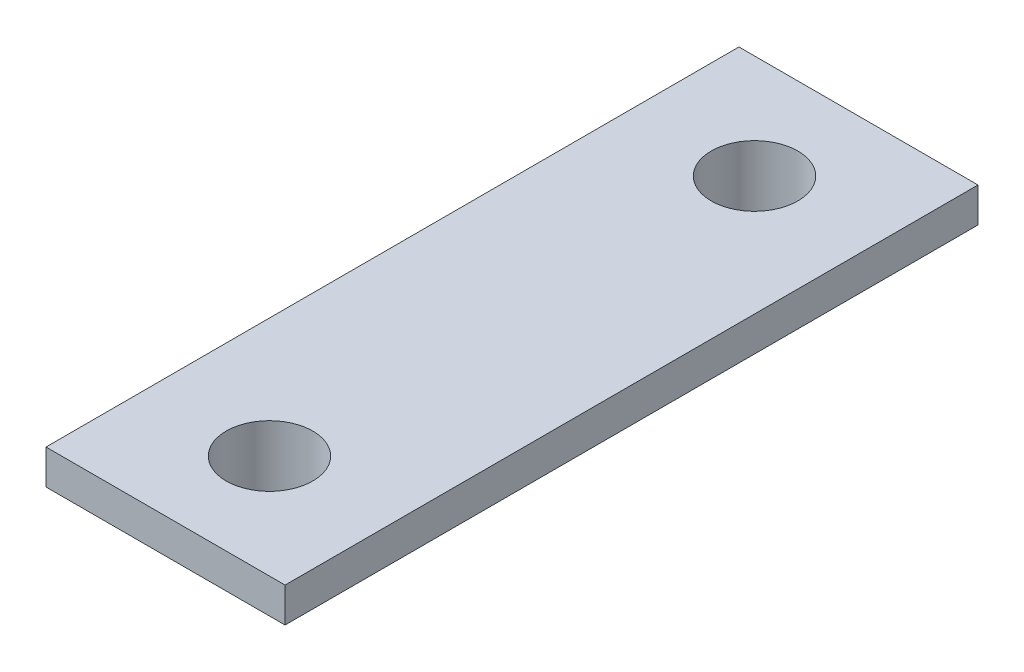
ISO-10303-21;
HEADER;
FILE_DESCRIPTION(('STEP AP214'),'2;1');
FILE_NAME('part.step','',(''),(''),'','','');
FILE_SCHEMA(('AUTOMOTIVE_DESIGN { 1 0 10303 214 1 1 1 1 }'));
ENDSEC;
DATA;
#1=APPLICATION_CONTEXT('core data for automotive mechanical design processes');
#2=APPLICATION_PROTOCOL_DEFINITION('international standard','automotive_design',2000,#1);
#3=PRODUCT_CONTEXT('',#1,'mechanical');
#4=PRODUCT('Part','Part','',(#3));
#5=PRODUCT_RELATED_PRODUCT_CATEGORY('part','',(#4));
#6=PRODUCT_DEFINITION_FORMATION('','',#4);
#7=PRODUCT_DEFINITION_CONTEXT('part definition',#1,'design');
#8=PRODUCT_DEFINITION('design','',#6,#7);
#9=PRODUCT_DEFINITION_SHAPE('','',#8);
#10=(LENGTH_UNIT() NAMED_UNIT(*) SI_UNIT(.MILLI.,.METRE.));
#11=(NAMED_UNIT(*) PLANE_ANGLE_UNIT() SI_UNIT($,.RADIAN.));
#12=(NAMED_UNIT(*) SI_UNIT($,.STERADIAN.) SOLID_ANGLE_UNIT());
#13=UNCERTAINTY_MEASURE_WITH_UNIT(LENGTH_MEASURE(1.E-05),#10,'distance_accuracy_value','');
#14=(GEOMETRIC_REPRESENTATION_CONTEXT(3) GLOBAL_UNCERTAINTY_ASSIGNED_CONTEXT((#13)) GLOBAL_UNIT_ASSIGNED_CONTEXT((#10,
#11,#12)) REPRESENTATION_CONTEXT('',''));
#15=CARTESIAN_POINT('',(0.,0.,0.));
#16=DIRECTION('',(0.,0.,1.));
#17=DIRECTION('',(1.,0.,0.));
#18=AXIS2_PLACEMENT_3D('',#15,#16,#17);
#19=CARTESIAN_POINT('',(3.45,1.,-10.));
#20=DIRECTION('',(-1.,0.,0.));
#21=DIRECTION('',(0.,0.,1.));
#22=AXIS2_PLACEMENT_3D('',#19,#20,#21);
#23=PLANE('',#22);
#24=DIRECTION('',(0.,0.,-1.));
#25=VECTOR('',#24,1.);
#26=CARTESIAN_POINT('',(3.45,0.,-10.));
#27=LINE('',#26,#25);
#28=CARTESIAN_POINT('',(3.45,0.,10.));
#29=VERTEX_POINT('',#28);
#30=CARTESIAN_POINT('',(3.45,0.,-10.));
#31=VERTEX_POINT('',#30);
#32=EDGE_CURVE('E100',#29,#31,#27,.T.);
#33=ORIENTED_EDGE('',*,*,#32,.T.);
#34=DIRECTION('',(0.,-1.,0.));
#35=VECTOR('',#34,1.);
#36=CARTESIAN_POINT('',(3.45,1.,-10.));
#37=LINE('',#36,#35);
#38=CARTESIAN_POINT('',(3.45,1.,-10.));
#39=VERTEX_POINT('',#38);
#40=EDGE_CURVE('E42',#39,#31,#37,.T.);
#41=ORIENTED_EDGE('',*,*,#40,.F.);
#42=DIRECTION('',(0.,0.,-1.));
#43=VECTOR('',#42,1.);
#44=CARTESIAN_POINT('',(3.45,1.,-10.));
#45=LINE('',#44,#43);
#46=CARTESIAN_POINT('',(3.45,1.,10.));
#47=VERTEX_POINT('',#46);
#48=EDGE_CURVE('E86',#47,#39,#45,.T.);
#49=ORIENTED_EDGE('',*,*,#48,.F.);
#50=DIRECTION('',(0.,-1.,0.));
#51=VECTOR('',#50,1.);
#52=CARTESIAN_POINT('',(3.45,1.,10.));
#53=LINE('',#52,#51);
#54=EDGE_CURVE('E96',#47,#29,#53,.T.);
#55=ORIENTED_EDGE('',*,*,#54,.T.);
#56=EDGE_LOOP('',(#33,#41,#49,#55));
#57=FACE_BOUND('',#56,.T.);
#58=ADVANCED_FACE('F34',(#57),#23,.F.);
#59=CARTESIAN_POINT('',(-3.45,1.,-10.));
#60=DIRECTION('',(0.,0.,1.));
#61=DIRECTION('',(1.,0.,0.));
#62=AXIS2_PLACEMENT_3D('',#59,#60,#61);
#63=PLANE('',#62);
#64=DIRECTION('',(-1.,0.,0.));
#65=VECTOR('',#64,1.);
#66=CARTESIAN_POINT('',(-3.45,0.,-10.));
#67=LINE('',#66,#65);
#68=CARTESIAN_POINT('',(-3.45,0.,-10.));
#69=VERTEX_POINT('',#68);
#70=EDGE_CURVE('E91',#31,#69,#67,.T.);
#71=ORIENTED_EDGE('',*,*,#70,.T.);
#72=DIRECTION('',(0.,-1.,0.));
#73=VECTOR('',#72,1.);
#74=CARTESIAN_POINT('',(-3.45,1.,-10.));
#75=LINE('',#74,#73);
#76=CARTESIAN_POINT('',(-3.45,1.,-10.));
#77=VERTEX_POINT('',#76);
#78=EDGE_CURVE('E89',#77,#69,#75,.T.);
#79=ORIENTED_EDGE('',*,*,#78,.F.);
#80=DIRECTION('',(-1.,0.,0.));
#81=VECTOR('',#80,1.);
#82=CARTESIAN_POINT('',(-3.45,1.,-10.));
#83=LINE('',#82,#81);
#84=EDGE_CURVE('E81',#39,#77,#83,.T.);
#85=ORIENTED_EDGE('',*,*,#84,.F.);
#86=ORIENTED_EDGE('',*,*,#40,.T.);
#87=EDGE_LOOP('',(#71,#79,#85,#86));
#88=FACE_BOUND('',#87,.T.);
#89=ADVANCED_FACE('F90',(#88),#63,.F.);
#90=CARTESIAN_POINT('',(-3.45,1.,-10.));
#91=DIRECTION('',(1.,0.,0.));
#92=DIRECTION('',(0.,0.,-1.));
#93=AXIS2_PLACEMENT_3D('',#90,#91,#92);
#94=PLANE('',#93);
#95=DIRECTION('',(0.,0.,1.));
#96=VECTOR('',#95,1.);
#97=CARTESIAN_POINT('',(-3.45,0.,-10.));
#98=LINE('',#97,#96);
#99=CARTESIAN_POINT('',(-3.45,0.,10.));
#100=VERTEX_POINT('',#99);
#101=EDGE_CURVE('E67',#69,#100,#98,.T.);
#102=ORIENTED_EDGE('',*,*,#101,.T.);
#103=DIRECTION('',(0.,-1.,0.));
#104=VECTOR('',#103,1.);
#105=CARTESIAN_POINT('',(-3.45,1.,10.));
#106=LINE('',#105,#104);
#107=CARTESIAN_POINT('',(-3.45,1.,10.));
#108=VERTEX_POINT('',#107);
#109=EDGE_CURVE('E92',#108,#100,#106,.T.);
#110=ORIENTED_EDGE('',*,*,#109,.F.);
#111=DIRECTION('',(0.,0.,1.));
#112=VECTOR('',#111,1.);
#113=CARTESIAN_POINT('',(-3.45,1.,-10.));
#114=LINE('',#113,#112);
#115=EDGE_CURVE('E84',#77,#108,#114,.T.);
#116=ORIENTED_EDGE('',*,*,#115,.F.);
#117=ORIENTED_EDGE('',*,*,#78,.T.);
#118=EDGE_LOOP('',(#102,#110,#116,#117));
#119=FACE_BOUND('',#118,.T.);
#120=ADVANCED_FACE('F94',(#119),#94,.F.);
#121=CARTESIAN_POINT('',(-3.45,1.,10.));
#122=DIRECTION('',(0.,0.,-1.));
#123=DIRECTION('',(-1.,0.,0.));
#124=AXIS2_PLACEMENT_3D('',#121,#122,#123);
#125=PLANE('',#124);
#126=DIRECTION('',(1.,0.,0.));
#127=VECTOR('',#126,1.);
#128=CARTESIAN_POINT('',(-3.45,0.,10.));
#129=LINE('',#128,#127);
#130=EDGE_CURVE('E73',#100,#29,#129,.T.);
#131=ORIENTED_EDGE('',*,*,#130,.T.);
#132=ORIENTED_EDGE('',*,*,#54,.F.);
#133=DIRECTION('',(1.,0.,0.));
#134=VECTOR('',#133,1.);
#135=CARTESIAN_POINT('',(-3.45,1.,10.));
#136=LINE('',#135,#134);
#137=EDGE_CURVE('E50',#108,#47,#136,.T.);
#138=ORIENTED_EDGE('',*,*,#137,.F.);
#139=ORIENTED_EDGE('',*,*,#109,.T.);
#140=EDGE_LOOP('',(#131,#132,#138,#139));
#141=FACE_BOUND('',#140,.T.);
#142=ADVANCED_FACE('F123',(#141),#125,.F.);
#143=CARTESIAN_POINT('',(0.,1.,0.));
#144=DIRECTION('',(0.,1.,0.));
#145=DIRECTION('',(0.,0.,1.));
#146=AXIS2_PLACEMENT_3D('',#143,#144,#145);
#147=PLANE('',#146);
#148=CARTESIAN_POINT('',(0.,1.,7.));
#149=DIRECTION('',(0.,1.,0.));
#150=DIRECTION('',(0.,0.,1.));
#151=AXIS2_PLACEMENT_3D('',#148,#149,#150);
#152=CIRCLE('',#151,1.25);
#153=CARTESIAN_POINT('',(0.,1.,8.25));
#154=VERTEX_POINT('',#153);
#155=EDGE_CURVE('E215',#154,#154,#152,.T.);
#156=ORIENTED_EDGE('',*,*,#155,.F.);
#157=EDGE_LOOP('',(#156));
#158=FACE_BOUND('',#157,.T.);
#159=CARTESIAN_POINT('',(0.,1.,-7.));
#160=DIRECTION('',(0.,1.,0.));
#161=DIRECTION('',(0.,0.,1.));
#162=AXIS2_PLACEMENT_3D('',#159,#160,#161);
#163=CIRCLE('',#162,1.25);
#164=CARTESIAN_POINT('',(0.,1.,-5.75));
#165=VERTEX_POINT('',#164);
#166=EDGE_CURVE('E209',#165,#165,#163,.T.);
#167=ORIENTED_EDGE('',*,*,#166,.F.);
#168=EDGE_LOOP('',(#167));
#169=FACE_BOUND('',#168,.T.);
#170=ORIENTED_EDGE('',*,*,#48,.T.);
#171=ORIENTED_EDGE('',*,*,#84,.T.);
#172=ORIENTED_EDGE('',*,*,#115,.T.);
#173=ORIENTED_EDGE('',*,*,#137,.T.);
#174=EDGE_LOOP('',(#170,#171,#172,#173));
#175=FACE_BOUND('',#174,.T.);
#176=ADVANCED_FACE('F82',(#158,#169,#175),#147,.T.);
#177=CARTESIAN_POINT('',(0.,0.,0.));
#178=DIRECTION('',(0.,1.,0.));
#179=DIRECTION('',(0.,0.,1.));
#180=AXIS2_PLACEMENT_3D('',#177,#178,#179);
#181=PLANE('',#180);
#182=CARTESIAN_POINT('',(0.,0.,7.));
#183=DIRECTION('',(0.,1.,0.));
#184=DIRECTION('',(0.,0.,1.));
#185=AXIS2_PLACEMENT_3D('',#182,#183,#184);
#186=CIRCLE('',#185,1.9);
#187=CARTESIAN_POINT('',(0.,0.,8.9));
#188=VERTEX_POINT('',#187);
#189=EDGE_CURVE('E204',#188,#188,#186,.T.);
#190=ORIENTED_EDGE('',*,*,#189,.T.);
#191=EDGE_LOOP('',(#190));
#192=FACE_BOUND('',#191,.T.);
#193=CARTESIAN_POINT('',(0.,0.,-7.));
#194=DIRECTION('',(0.,1.,0.));
#195=DIRECTION('',(0.,0.,1.));
#196=AXIS2_PLACEMENT_3D('',#193,#194,#195);
#197=CIRCLE('',#196,1.9);
#198=CARTESIAN_POINT('',(0.,0.,-5.1));
#199=VERTEX_POINT('',#198);
#200=EDGE_CURVE('E11',#199,#199,#197,.F.);
#201=ORIENTED_EDGE('',*,*,#200,.F.);
#202=EDGE_LOOP('',(#201));
#203=FACE_BOUND('',#202,.T.);
#204=ORIENTED_EDGE('',*,*,#32,.F.);
#205=ORIENTED_EDGE('',*,*,#130,.F.);
#206=ORIENTED_EDGE('',*,*,#101,.F.);
#207=ORIENTED_EDGE('',*,*,#70,.F.);
#208=EDGE_LOOP('',(#204,#205,#206,#207));
#209=FACE_BOUND('',#208,.T.);
#210=ADVANCED_FACE('F111',(#192,#203,#209),#181,.F.);
#211=CARTESIAN_POINT('',(0.,-0.8,-7.));
#212=DIRECTION('',(0.,1.,0.));
#213=DIRECTION('',(0.,0.,1.));
#214=AXIS2_PLACEMENT_3D('',#211,#212,#213);
#215=CYLINDRICAL_SURFACE('',#214,1.9);
#216=CARTESIAN_POINT('',(0.,-0.8,-7.));
#217=DIRECTION('',(0.,-1.,0.));
#218=DIRECTION('',(0.,0.,-1.));
#219=AXIS2_PLACEMENT_3D('',#216,#217,#218);
#220=CIRCLE('',#219,1.9);
#221=CARTESIAN_POINT('',(0.,-0.8,-8.9));
#222=VERTEX_POINT('',#221);
#223=EDGE_CURVE('E103',#222,#222,#220,.T.);
#224=ORIENTED_EDGE('',*,*,#223,.F.);
#225=EDGE_LOOP('',(#224));
#226=FACE_BOUND('',#225,.T.);
#227=ORIENTED_EDGE('',*,*,#200,.T.);
#228=EDGE_LOOP('',(#227));
#229=FACE_BOUND('',#228,.T.);
#230=ADVANCED_FACE('F113',(#226,#229),#215,.T.);
#231=CARTESIAN_POINT('',(0.,-0.8,-7.));
#232=DIRECTION('',(0.,-1.,0.));
#233=DIRECTION('',(0.,0.,-1.));
#234=AXIS2_PLACEMENT_3D('',#231,#232,#233);
#235=PLANE('',#234);
#236=CARTESIAN_POINT('',(0.,-0.8,-7.));
#237=DIRECTION('',(0.,1.,0.));
#238=DIRECTION('',(0.,0.,1.));
#239=AXIS2_PLACEMENT_3D('',#236,#237,#238);
#240=CIRCLE('',#239,1.25);
#241=CARTESIAN_POINT('',(0.,-0.8,-5.75));
#242=VERTEX_POINT('',#241);
#243=EDGE_CURVE('E198',#242,#242,#240,.T.);
#244=ORIENTED_EDGE('',*,*,#243,.T.);
#245=EDGE_LOOP('',(#244));
#246=FACE_BOUND('',#245,.T.);
#247=ORIENTED_EDGE('',*,*,#223,.T.);
#248=EDGE_LOOP('',(#247));
#249=FACE_BOUND('',#248,.T.);
#250=ADVANCED_FACE('F120',(#246,#249),#235,.T.);
#251=CARTESIAN_POINT('',(0.,-0.8,7.));
#252=DIRECTION('',(0.,1.,0.));
#253=DIRECTION('',(0.,0.,1.));
#254=AXIS2_PLACEMENT_3D('',#251,#252,#253);
#255=CYLINDRICAL_SURFACE('',#254,1.9);
#256=CARTESIAN_POINT('',(0.,-0.8,7.));
#257=DIRECTION('',(0.,1.,0.));
#258=DIRECTION('',(0.,0.,1.));
#259=AXIS2_PLACEMENT_3D('',#256,#257,#258);
#260=CIRCLE('',#259,1.9);
#261=CARTESIAN_POINT('',(0.,-0.8,8.9));
#262=VERTEX_POINT('',#261);
#263=EDGE_CURVE('E201',#262,#262,#260,.T.);
#264=ORIENTED_EDGE('',*,*,#263,.T.);
#265=EDGE_LOOP('',(#264));
#266=FACE_BOUND('',#265,.T.);
#267=ORIENTED_EDGE('',*,*,#189,.F.);
#268=EDGE_LOOP('',(#267));
#269=FACE_BOUND('',#268,.T.);
#270=ADVANCED_FACE('F164',(#266,#269),#255,.T.);
#271=CARTESIAN_POINT('',(0.,-0.8,7.));
#272=DIRECTION('',(0.,-1.,0.));
#273=DIRECTION('',(0.,0.,1.));
#274=AXIS2_PLACEMENT_3D('',#271,#272,#273);
#275=PLANE('',#274);
#276=CARTESIAN_POINT('',(0.,-0.8,7.));
#277=DIRECTION('',(0.,1.,0.));
#278=DIRECTION('',(0.,0.,1.));
#279=AXIS2_PLACEMENT_3D('',#276,#277,#278);
#280=CIRCLE('',#279,1.25);
#281=CARTESIAN_POINT('',(0.,-0.8,8.25));
#282=VERTEX_POINT('',#281);
#283=EDGE_CURVE('E212',#282,#282,#280,.T.);
#284=ORIENTED_EDGE('',*,*,#283,.T.);
#285=EDGE_LOOP('',(#284));
#286=FACE_BOUND('',#285,.T.);
#287=ORIENTED_EDGE('',*,*,#263,.F.);
#288=EDGE_LOOP('',(#287));
#289=FACE_BOUND('',#288,.T.);
#290=ADVANCED_FACE('F159',(#286,#289),#275,.T.);
#291=CARTESIAN_POINT('',(0.,1.,-7.));
#292=DIRECTION('',(0.,1.,0.));
#293=DIRECTION('',(0.,0.,1.));
#294=AXIS2_PLACEMENT_3D('',#291,#292,#293);
#295=CYLINDRICAL_SURFACE('',#294,1.25);
#296=ORIENTED_EDGE('',*,*,#243,.F.);
#297=EDGE_LOOP('',(#296));
#298=FACE_BOUND('',#297,.T.);
#299=ORIENTED_EDGE('',*,*,#166,.T.);
#300=EDGE_LOOP('',(#299));
#301=FACE_BOUND('',#300,.T.);
#302=ADVANCED_FACE('F154',(#298,#301),#295,.F.);
#303=CARTESIAN_POINT('',(0.,1.,7.));
#304=DIRECTION('',(0.,1.,0.));
#305=DIRECTION('',(0.,0.,1.));
#306=AXIS2_PLACEMENT_3D('',#303,#304,#305);
#307=CYLINDRICAL_SURFACE('',#306,1.25);
#308=ORIENTED_EDGE('',*,*,#283,.F.);
#309=EDGE_LOOP('',(#308));
#310=FACE_BOUND('',#309,.T.);
#311=ORIENTED_EDGE('',*,*,#155,.T.);
#312=EDGE_LOOP('',(#311));
#313=FACE_BOUND('',#312,.T.);
#314=ADVANCED_FACE('F173',(#310,#313),#307,.F.);
#315=CLOSED_SHELL('',(#58,#89,#120,#142,#176,#210,#230,#250,#270,#290,#302,#314));
#316=MANIFOLD_SOLID_BREP('B2',#315);
#317=ADVANCED_BREP_SHAPE_REPRESENTATION('',(#18,#316),#14);
#318=SHAPE_DEFINITION_REPRESENTATION(#9,#317);
ENDSEC;
END-ISO-10303-21;
